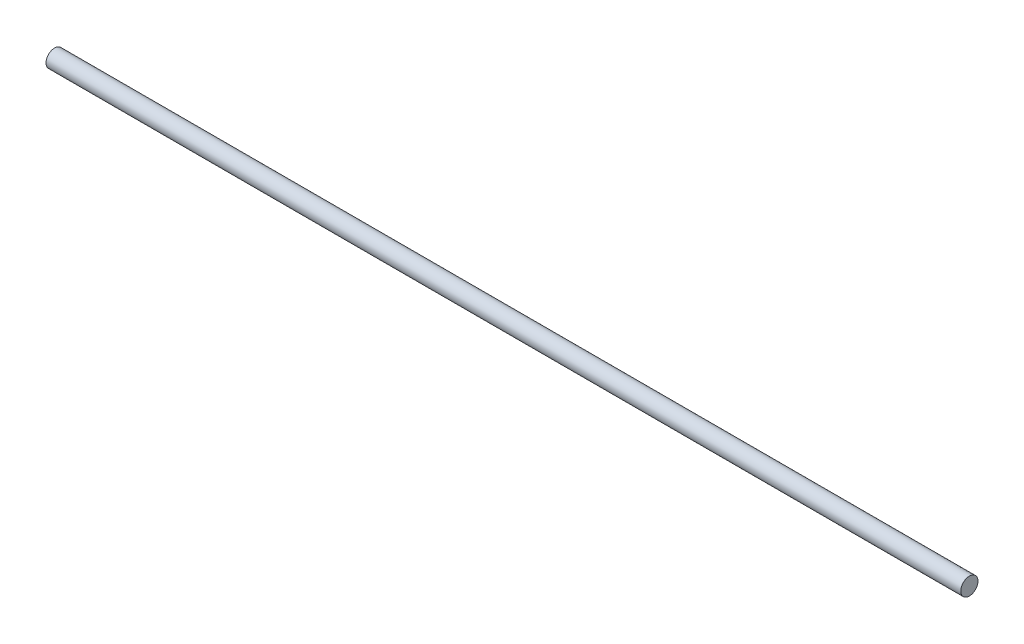
ISO-10303-21;
HEADER;
FILE_DESCRIPTION(('STEP AP214'),'2;1');
FILE_NAME('part.step','',(''),(''),'','','');
FILE_SCHEMA(('AUTOMOTIVE_DESIGN { 1 0 10303 214 1 1 1 1 }'));
ENDSEC;
DATA;
#1=APPLICATION_CONTEXT('core data for automotive mechanical design processes');
#2=APPLICATION_PROTOCOL_DEFINITION('international standard','automotive_design',2000,#1);
#3=PRODUCT_CONTEXT('',#1,'mechanical');
#4=PRODUCT('Part','Part','',(#3));
#5=PRODUCT_RELATED_PRODUCT_CATEGORY('part','',(#4));
#6=PRODUCT_DEFINITION_FORMATION('','',#4);
#7=PRODUCT_DEFINITION_CONTEXT('part definition',#1,'design');
#8=PRODUCT_DEFINITION('design','',#6,#7);
#9=PRODUCT_DEFINITION_SHAPE('','',#8);
#10=(LENGTH_UNIT() NAMED_UNIT(*) SI_UNIT(.MILLI.,.METRE.));
#11=(NAMED_UNIT(*) PLANE_ANGLE_UNIT() SI_UNIT($,.RADIAN.));
#12=(NAMED_UNIT(*) SI_UNIT($,.STERADIAN.) SOLID_ANGLE_UNIT());
#13=UNCERTAINTY_MEASURE_WITH_UNIT(LENGTH_MEASURE(1.E-05),#10,'distance_accuracy_value','');
#14=(GEOMETRIC_REPRESENTATION_CONTEXT(3) GLOBAL_UNCERTAINTY_ASSIGNED_CONTEXT((#13)) GLOBAL_UNIT_ASSIGNED_CONTEXT((#10,
#11,#12)) REPRESENTATION_CONTEXT('',''));
#15=CARTESIAN_POINT('',(0.,0.,0.));
#16=DIRECTION('',(0.,0.,1.));
#17=DIRECTION('',(1.,0.,0.));
#18=AXIS2_PLACEMENT_3D('',#15,#16,#17);
#19=CARTESIAN_POINT('',(159.,0.,0.));
#20=DIRECTION('',(1.,0.,0.));
#21=DIRECTION('',(0.,0.,-1.));
#22=AXIS2_PLACEMENT_3D('',#19,#20,#21);
#23=PLANE('',#22);
#24=CARTESIAN_POINT('',(159.,0.,0.));
#25=DIRECTION('',(1.,0.,0.));
#26=DIRECTION('',(0.,0.,-1.));
#27=AXIS2_PLACEMENT_3D('',#24,#25,#26);
#28=CIRCLE('',#27,3.);
#29=CARTESIAN_POINT('',(159.,0.,-3.));
#30=VERTEX_POINT('',#29);
#31=EDGE_CURVE('E10',#30,#30,#28,.T.);
#32=ORIENTED_EDGE('',*,*,#31,.T.);
#33=EDGE_LOOP('',(#32));
#34=FACE_BOUND('',#33,.T.);
#35=CARTESIAN_POINT('',(159.,0.,0.));
#36=DIRECTION('',(1.,0.,0.));
#37=DIRECTION('',(0.,0.,-1.));
#38=AXIS2_PLACEMENT_3D('',#35,#36,#37);
#39=CIRCLE('',#38,0.00299999999999996);
#40=CARTESIAN_POINT('',(159.,0.,-0.00299999999999996));
#41=VERTEX_POINT('',#40);
#42=EDGE_CURVE('E42',#41,#41,#39,.T.);
#43=ORIENTED_EDGE('',*,*,#42,.F.);
#44=EDGE_LOOP('',(#43));
#45=FACE_BOUND('',#44,.T.);
#46=ADVANCED_FACE('F31',(#34,#45),#23,.T.);
#47=CARTESIAN_POINT('',(-159.,0.,0.));
#48=DIRECTION('',(1.,0.,0.));
#49=DIRECTION('',(0.,0.,-1.));
#50=AXIS2_PLACEMENT_3D('',#47,#48,#49);
#51=PLANE('',#50);
#52=CARTESIAN_POINT('',(-159.,0.,0.));
#53=DIRECTION('',(1.,0.,0.));
#54=DIRECTION('',(0.,0.,-1.));
#55=AXIS2_PLACEMENT_3D('',#52,#53,#54);
#56=CIRCLE('',#55,3.);
#57=CARTESIAN_POINT('',(-159.,0.,-3.));
#58=VERTEX_POINT('',#57);
#59=EDGE_CURVE('E35',#58,#58,#56,.T.);
#60=ORIENTED_EDGE('',*,*,#59,.F.);
#61=EDGE_LOOP('',(#60));
#62=FACE_BOUND('',#61,.T.);
#63=CARTESIAN_POINT('',(-159.,0.,0.));
#64=DIRECTION('',(1.,0.,0.));
#65=DIRECTION('',(0.,0.,-1.));
#66=AXIS2_PLACEMENT_3D('',#63,#64,#65);
#67=CIRCLE('',#66,0.00299999999999996);
#68=CARTESIAN_POINT('',(-159.,0.,-0.00299999999999996));
#69=VERTEX_POINT('',#68);
#70=EDGE_CURVE('E44',#69,#69,#67,.T.);
#71=ORIENTED_EDGE('',*,*,#70,.T.);
#72=EDGE_LOOP('',(#71));
#73=FACE_BOUND('',#72,.T.);
#74=ADVANCED_FACE('F54',(#62,#73),#51,.F.);
#75=CARTESIAN_POINT('',(159.,0.,0.));
#76=DIRECTION('',(-1.,0.,0.));
#77=DIRECTION('',(0.,0.,1.));
#78=AXIS2_PLACEMENT_3D('',#75,#76,#77);
#79=CYLINDRICAL_SURFACE('',#78,3.);
#80=ORIENTED_EDGE('',*,*,#31,.F.);
#81=EDGE_LOOP('',(#80));
#82=FACE_BOUND('',#81,.T.);
#83=ORIENTED_EDGE('',*,*,#59,.T.);
#84=EDGE_LOOP('',(#83));
#85=FACE_BOUND('',#84,.T.);
#86=ADVANCED_FACE('F33',(#82,#85),#79,.T.);
#87=CARTESIAN_POINT('',(159.,0.,0.));
#88=DIRECTION('',(-1.,0.,0.));
#89=DIRECTION('',(0.,0.,1.));
#90=AXIS2_PLACEMENT_3D('',#87,#88,#89);
#91=CYLINDRICAL_SURFACE('',#90,0.00299999999999996);
#92=ORIENTED_EDGE('',*,*,#42,.T.);
#93=EDGE_LOOP('',(#92));
#94=FACE_BOUND('',#93,.T.);
#95=ORIENTED_EDGE('',*,*,#70,.F.);
#96=EDGE_LOOP('',(#95));
#97=FACE_BOUND('',#96,.T.);
#98=ADVANCED_FACE('F50',(#94,#97),#91,.F.);
#99=CLOSED_SHELL('',(#46,#74,#86,#98));
#100=MANIFOLD_SOLID_BREP('B2',#99);
#101=ADVANCED_BREP_SHAPE_REPRESENTATION('',(#18,#100),#14);
#102=SHAPE_DEFINITION_REPRESENTATION(#9,#101);
ENDSEC;
END-ISO-10303-21;
